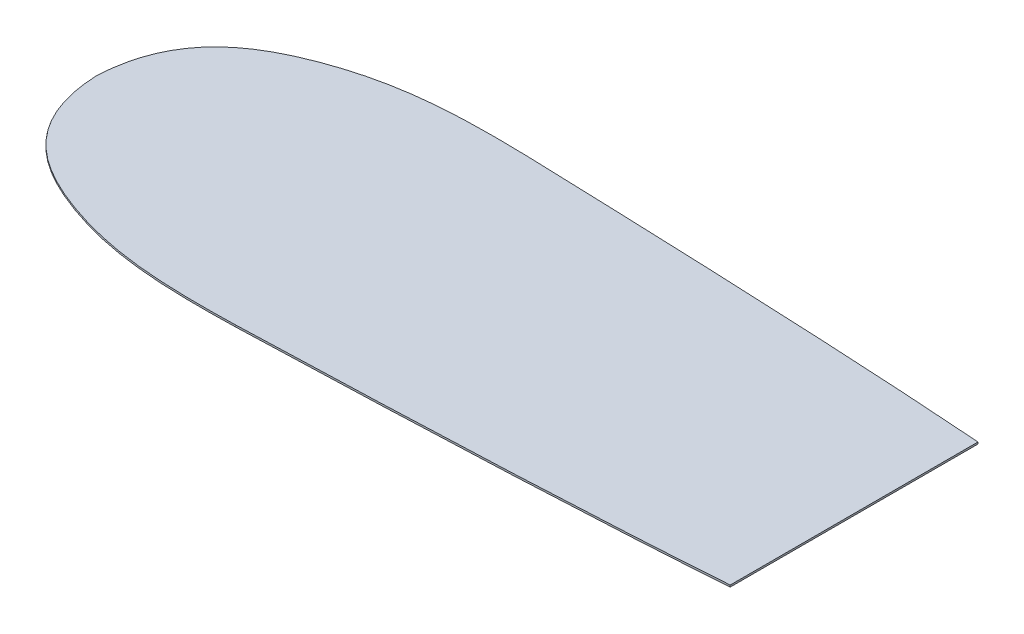
ISO-10303-21;
HEADER;
FILE_DESCRIPTION(('STEP AP214'),'2;1');
FILE_NAME('part.step','',(''),(''),'','','');
FILE_SCHEMA(('AUTOMOTIVE_DESIGN { 1 0 10303 214 1 1 1 1 }'));
ENDSEC;
DATA;
#1=APPLICATION_CONTEXT('core data for automotive mechanical design processes');
#2=APPLICATION_PROTOCOL_DEFINITION('international standard','automotive_design',2000,#1);
#3=PRODUCT_CONTEXT('',#1,'mechanical');
#4=PRODUCT('Part','Part','',(#3));
#5=PRODUCT_RELATED_PRODUCT_CATEGORY('part','',(#4));
#6=PRODUCT_DEFINITION_FORMATION('','',#4);
#7=PRODUCT_DEFINITION_CONTEXT('part definition',#1,'design');
#8=PRODUCT_DEFINITION('design','',#6,#7);
#9=PRODUCT_DEFINITION_SHAPE('','',#8);
#10=(LENGTH_UNIT() NAMED_UNIT(*) SI_UNIT(.MILLI.,.METRE.));
#11=(NAMED_UNIT(*) PLANE_ANGLE_UNIT() SI_UNIT($,.RADIAN.));
#12=(NAMED_UNIT(*) SI_UNIT($,.STERADIAN.) SOLID_ANGLE_UNIT());
#13=UNCERTAINTY_MEASURE_WITH_UNIT(LENGTH_MEASURE(1.E-05),#10,'distance_accuracy_value','');
#14=(GEOMETRIC_REPRESENTATION_CONTEXT(3) GLOBAL_UNCERTAINTY_ASSIGNED_CONTEXT((#13)) GLOBAL_UNIT_ASSIGNED_CONTEXT((#10,
#11,#12)) REPRESENTATION_CONTEXT('',''));
#15=CARTESIAN_POINT('',(0.,0.,0.));
#16=DIRECTION('',(0.,0.,1.));
#17=DIRECTION('',(1.,0.,0.));
#18=AXIS2_PLACEMENT_3D('',#15,#16,#17);
#19=CARTESIAN_POINT('',(408.55786592669,-53.8054593201718,-67.9864555983957));
#20=CARTESIAN_POINT('',(405.510783420296,-53.8054593201718,-68.2125918880234));
#21=CARTESIAN_POINT('',(400.163981406909,-53.8054593201718,-68.5997088697524));
#22=CARTESIAN_POINT('',(392.250191928234,-53.8054593201718,-69.1488737365903));
#23=CARTESIAN_POINT('',(384.914397369842,-53.8054593201718,-69.6396549512759));
#24=CARTESIAN_POINT('',(374.982367763208,-53.8054593201718,-70.2810009126777));
#25=CARTESIAN_POINT('',(362.311251705908,-53.8054593201718,-71.0577519191519));
#26=CARTESIAN_POINT('',(346.740657608973,-53.8054593201718,-71.9514358969247));
#27=CARTESIAN_POINT('',(330.853990323014,-53.8054593201718,-72.8078328315605));
#28=CARTESIAN_POINT('',(309.314194489395,-53.8054593201718,-73.901615514884));
#29=CARTESIAN_POINT('',(281.839500237322,-53.8054593201718,-75.1817055951182));
#30=CARTESIAN_POINT('',(248.374978256432,-53.8054593201718,-76.5881028931925));
#31=CARTESIAN_POINT('',(220.395834826739,-53.8054593201718,-77.6600997884309));
#32=CARTESIAN_POINT('',(198.15035735344,-53.8054593201718,-78.4625882976674));
#33=CARTESIAN_POINT('',(181.581427956624,-53.8054593201718,-79.0380575632732));
#34=CARTESIAN_POINT('',(167.916202612748,-53.8054593201718,-79.4968375830163));
#35=CARTESIAN_POINT('',(157.085804706728,-53.8054593201718,-79.8513358953218));
#36=CARTESIAN_POINT('',(151.73308734373,-53.8054593201718,-80.0252689768728));
#37=CARTESIAN_POINT('',(149.052426061608,-53.8054593201718,-80.1099839148504));
#38=B_SPLINE_CURVE_WITH_KNOTS('',3,(#19,#20,#21,#22,#23,#24,#25,#26,#27,#28,#29,#30,#31,#32,#33,
#34,#35,#36,#37),.UNSPECIFIED.,.F.,.F.,(4,1,1,1,1,1,1,1,1,1,1,1,1,1,1,1,4),(0.431997815299734,
0.454757420142134,0.472524007466795,0.490290594791455,0.508057182116116,0.543590356765438,
0.579123531414759,0.614656706064081,0.650189880713402,0.721256230012046,0.792322579310689,
0.863388928609332,0.898922103258653,0.934455277907975,0.969988452557297,0.987755039881957,
1.00548018721655),.UNSPECIFIED.);
#39=DIRECTION('',(0.,-1.,0.));
#40=VECTOR('',#39,1.);
#41=SURFACE_OF_LINEAR_EXTRUSION('',#38,#40);
#42=CARTESIAN_POINT('',(408.55786592669,-54.8054593201718,-67.9864555983957));
#43=CARTESIAN_POINT('',(405.510783420296,-54.8054593201718,-68.2125918880234));
#44=CARTESIAN_POINT('',(400.163981406909,-54.8054593201718,-68.5997088697524));
#45=CARTESIAN_POINT('',(392.250191928234,-54.8054593201718,-69.1488737365903));
#46=CARTESIAN_POINT('',(384.914397369842,-54.8054593201718,-69.6396549512759));
#47=CARTESIAN_POINT('',(374.982367763208,-54.8054593201718,-70.2810009126777));
#48=CARTESIAN_POINT('',(362.311251705908,-54.8054593201718,-71.0577519191519));
#49=CARTESIAN_POINT('',(346.740657608973,-54.8054593201718,-71.9514358969247));
#50=CARTESIAN_POINT('',(330.853990323014,-54.8054593201718,-72.8078328315605));
#51=CARTESIAN_POINT('',(309.314194489395,-54.8054593201718,-73.901615514884));
#52=CARTESIAN_POINT('',(281.839500237322,-54.8054593201718,-75.1817055951182));
#53=CARTESIAN_POINT('',(248.374978256432,-54.8054593201718,-76.5881028931925));
#54=CARTESIAN_POINT('',(220.395834826739,-54.8054593201718,-77.6600997884309));
#55=CARTESIAN_POINT('',(198.15035735344,-54.8054593201718,-78.4625882976674));
#56=CARTESIAN_POINT('',(181.581427956624,-54.8054593201718,-79.0380575632732));
#57=CARTESIAN_POINT('',(167.916202612748,-54.8054593201718,-79.4968375830163));
#58=CARTESIAN_POINT('',(157.085804706728,-54.8054593201718,-79.8513358953218));
#59=CARTESIAN_POINT('',(151.73308734373,-54.8054593201718,-80.0252689768728));
#60=CARTESIAN_POINT('',(149.052426061608,-54.8054593201718,-80.1099839148504));
#61=B_SPLINE_CURVE_WITH_KNOTS('',3,(#42,#43,#44,#45,#46,#47,#48,#49,#50,#51,#52,#53,#54,#55,#56,
#57,#58,#59,#60),.UNSPECIFIED.,.F.,.F.,(4,1,1,1,1,1,1,1,1,1,1,1,1,1,1,1,4),(0.431997815299734,
0.454757420142134,0.472524007466795,0.490290594791455,0.508057182116116,0.543590356765438,
0.579123531414759,0.614656706064081,0.650189880713402,0.721256230012046,0.792322579310689,
0.863388928609332,0.898922103258653,0.934455277907975,0.969988452557297,0.987755039881957,
1.00548018721655),.UNSPECIFIED.);
#62=CARTESIAN_POINT('',(408.55786592669,-54.8054593201718,-67.9864555983957));
#63=VERTEX_POINT('',#62);
#64=CARTESIAN_POINT('',(149.052426061608,-54.8054593201718,-80.1099839148504));
#65=VERTEX_POINT('',#64);
#66=EDGE_CURVE('E196',#63,#65,#61,.T.);
#67=ORIENTED_EDGE('',*,*,#66,.T.);
#68=DIRECTION('',(0.,-1.,0.));
#69=VECTOR('',#68,1.);
#70=CARTESIAN_POINT('',(149.052426061608,-53.8054593201718,-80.1099839148504));
#71=LINE('',#70,#69);
#72=CARTESIAN_POINT('',(149.052426061608,-53.8054593201718,-80.1099839148504));
#73=VERTEX_POINT('',#72);
#74=EDGE_CURVE('E11',#73,#65,#71,.T.);
#75=ORIENTED_EDGE('',*,*,#74,.F.);
#76=CARTESIAN_POINT('',(408.55786592669,-53.8054593201718,-67.9864555983957));
#77=VERTEX_POINT('',#76);
#78=EDGE_CURVE('E162',#77,#73,#38,.T.);
#79=ORIENTED_EDGE('',*,*,#78,.F.);
#80=DIRECTION('',(0.,-1.,0.));
#81=VECTOR('',#80,1.);
#82=CARTESIAN_POINT('',(408.55786592669,-53.8054593201718,-67.9864555983957));
#83=LINE('',#82,#81);
#84=EDGE_CURVE('E124',#77,#63,#83,.T.);
#85=ORIENTED_EDGE('',*,*,#84,.T.);
#86=EDGE_LOOP('',(#67,#75,#79,#85));
#87=FACE_BOUND('',#86,.T.);
#88=ADVANCED_FACE('F37',(#87),#41,.F.);
#89=CARTESIAN_POINT('',(149.028750543071,-53.8054593201718,-80.11066733118));
#90=DIRECTION('',(-0.0288539311335215,0.,0.999583638650684));
#91=DIRECTION('',(0.999583638650684,0.,0.0288539311335215));
#92=AXIS2_PLACEMENT_3D('',#89,#90,#91);
#93=PLANE('',#92);
#94=DIRECTION('',(-0.999583638650684,0.,-0.0288539311335215));
#95=VECTOR('',#94,1.);
#96=CARTESIAN_POINT('',(149.028750543071,-54.8054593201718,-80.11066733118));
#97=LINE('',#96,#95);
#98=CARTESIAN_POINT('',(149.028750543071,-54.8054593201718,-80.11066733118));
#99=VERTEX_POINT('',#98);
#100=EDGE_CURVE('E192',#65,#99,#97,.T.);
#101=ORIENTED_EDGE('',*,*,#100,.T.);
#102=DIRECTION('',(0.,-1.,0.));
#103=VECTOR('',#102,1.);
#104=CARTESIAN_POINT('',(149.028750543071,-53.8054593201718,-80.11066733118));
#105=LINE('',#104,#103);
#106=CARTESIAN_POINT('',(149.028750543071,-53.8054593201718,-80.11066733118));
#107=VERTEX_POINT('',#106);
#108=EDGE_CURVE('E46',#107,#99,#105,.T.);
#109=ORIENTED_EDGE('',*,*,#108,.F.);
#110=DIRECTION('',(-0.999583638650684,0.,-0.0288539311335215));
#111=VECTOR('',#110,1.);
#112=CARTESIAN_POINT('',(149.028750543071,-53.8054593201718,-80.11066733118));
#113=LINE('',#112,#111);
#114=EDGE_CURVE('E94',#73,#107,#113,.T.);
#115=ORIENTED_EDGE('',*,*,#114,.F.);
#116=ORIENTED_EDGE('',*,*,#74,.T.);
#117=EDGE_LOOP('',(#101,#109,#115,#116));
#118=FACE_BOUND('',#117,.T.);
#119=ADVANCED_FACE('F221',(#118),#93,.F.);
#120=CARTESIAN_POINT('',(149.028750543071,-53.8054593201718,-80.11066733118));
#121=CARTESIAN_POINT('',(147.936484942707,-53.8054593201718,-80.1386493892276));
#122=CARTESIAN_POINT('',(145.736828581532,-53.8054593201718,-80.1916825245391));
#123=CARTESIAN_POINT('',(141.408319901193,-53.8054593201718,-80.2810310559996));
#124=CARTESIAN_POINT('',(136.077305493243,-53.8054593201718,-80.3596421931491));
#125=CARTESIAN_POINT('',(129.825005536494,-53.8054593201718,-80.3911964408756));
#126=CARTESIAN_POINT('',(121.661707268436,-53.8054593201718,-80.3374949657146));
#127=CARTESIAN_POINT('',(111.758463737462,-53.8054593201718,-80.0678700036652));
#128=CARTESIAN_POINT('',(96.4398148388706,-53.8054593201718,-79.107371438361));
#129=CARTESIAN_POINT('',(81.7392355131955,-53.8054593201718,-77.2086267598153));
#130=CARTESIAN_POINT('',(67.3006686165004,-53.8054593201718,-74.0803934381426));
#131=CARTESIAN_POINT('',(56.5150789245028,-53.8054593201718,-71.0465504739176));
#132=CARTESIAN_POINT('',(45.6701124182547,-53.8054593201718,-67.246019325421));
#133=CARTESIAN_POINT('',(34.7210770046295,-53.8054593201718,-62.618046065346));
#134=CARTESIAN_POINT('',(24.163921637311,-53.8054593201718,-56.8744169850821));
#135=CARTESIAN_POINT('',(14.4319882487774,-53.8054593201718,-49.7157372417068));
#136=CARTESIAN_POINT('',(7.36589000542728,-53.8054593201718,-42.3241872358674));
#137=CARTESIAN_POINT('',(2.53983813162882,-53.8054593201718,-35.3923832609049));
#138=CARTESIAN_POINT('',(-0.61608136272,-53.8054593201718,-29.6389185438804));
#139=CARTESIAN_POINT('',(-3.25637865488616,-53.8054593201718,-23.2838176192413));
#140=CARTESIAN_POINT('',(-4.98135778889993,-53.8054593201718,-17.4465742838462));
#141=CARTESIAN_POINT('',(-6.04739649435333,-53.8054593201718,-12.4277006341119));
#142=CARTESIAN_POINT('',(-6.68245616737414,-53.8054593201718,-8.48450608083049));
#143=CARTESIAN_POINT('',(-7.06854682921263,-53.8054593201718,-5.04024353060589));
#144=CARTESIAN_POINT('',(-7.28732861568636,-53.8054593201718,-2.19688642431227));
#145=CARTESIAN_POINT('',(-7.36676882648855,-53.8054593201718,-0.728822352487011));
#146=CARTESIAN_POINT('',(-7.39811467827044,-53.8054593201718,0.));
#147=B_SPLINE_CURVE_WITH_KNOTS('',3,(#120,#121,#122,#123,#124,#125,#126,#127,#128,#129,#130,
#131,#132,#133,#134,#135,#136,#137,#138,#139,#140,#141,#142,#143,#144,#145,#146),.UNSPECIFIED.,
.F.,.F.,(4,1,1,1,1,1,1,1,1,1,1,1,1,1,1,1,1,1,1,1,1,1,1,1,4),(0.000305151712854408,
0.0128609903837068,0.0254814775346114,0.0507224518364203,0.0759634261382294,0.101204400440038,
0.151686349043657,0.202168297647275,0.303132194854511,0.353614143458129,0.404096092061747,
0.454578040665365,0.505059989268983,0.555541937872601,0.606023886476219,0.656505835079837,
0.681746809381646,0.706987783683455,0.732228757985264,0.757469732287074,0.770090219437978,
0.782710706588883,0.795331193739787,0.801641437315239,0.807951680890692),.UNSPECIFIED.);
#148=DIRECTION('',(0.,-1.,0.));
#149=VECTOR('',#148,1.);
#150=SURFACE_OF_LINEAR_EXTRUSION('',#147,#149);
#151=CARTESIAN_POINT('',(149.028750543071,-54.8054593201718,-80.11066733118));
#152=CARTESIAN_POINT('',(147.936484942707,-54.8054593201718,-80.1386493892276));
#153=CARTESIAN_POINT('',(145.736828581532,-54.8054593201718,-80.1916825245391));
#154=CARTESIAN_POINT('',(141.408319901193,-54.8054593201718,-80.2810310559996));
#155=CARTESIAN_POINT('',(136.077305493243,-54.8054593201718,-80.3596421931491));
#156=CARTESIAN_POINT('',(129.825005536494,-54.8054593201718,-80.3911964408756));
#157=CARTESIAN_POINT('',(121.661707268436,-54.8054593201718,-80.3374949657146));
#158=CARTESIAN_POINT('',(111.758463737462,-54.8054593201718,-80.0678700036652));
#159=CARTESIAN_POINT('',(96.4398148388706,-54.8054593201718,-79.107371438361));
#160=CARTESIAN_POINT('',(81.7392355131955,-54.8054593201718,-77.2086267598153));
#161=CARTESIAN_POINT('',(67.3006686165004,-54.8054593201718,-74.0803934381426));
#162=CARTESIAN_POINT('',(56.5150789245028,-54.8054593201718,-71.0465504739176));
#163=CARTESIAN_POINT('',(45.6701124182547,-54.8054593201718,-67.246019325421));
#164=CARTESIAN_POINT('',(34.7210770046295,-54.8054593201718,-62.618046065346));
#165=CARTESIAN_POINT('',(24.163921637311,-54.8054593201718,-56.8744169850821));
#166=CARTESIAN_POINT('',(14.4319882487774,-54.8054593201718,-49.7157372417068));
#167=CARTESIAN_POINT('',(7.36589000542728,-54.8054593201718,-42.3241872358674));
#168=CARTESIAN_POINT('',(2.53983813162882,-54.8054593201718,-35.3923832609049));
#169=CARTESIAN_POINT('',(-0.61608136272,-54.8054593201718,-29.6389185438804));
#170=CARTESIAN_POINT('',(-3.25637865488616,-54.8054593201718,-23.2838176192413));
#171=CARTESIAN_POINT('',(-4.98135778889993,-54.8054593201718,-17.4465742838462));
#172=CARTESIAN_POINT('',(-6.04739649435333,-54.8054593201718,-12.4277006341119));
#173=CARTESIAN_POINT('',(-6.68245616737414,-54.8054593201718,-8.48450608083049));
#174=CARTESIAN_POINT('',(-7.06854682921263,-54.8054593201718,-5.04024353060589));
#175=CARTESIAN_POINT('',(-7.28732861568636,-54.8054593201718,-2.19688642431227));
#176=CARTESIAN_POINT('',(-7.36676882648855,-54.8054593201718,-0.728822352487011));
#177=CARTESIAN_POINT('',(-7.39811467827044,-54.8054593201718,0.));
#178=B_SPLINE_CURVE_WITH_KNOTS('',3,(#151,#152,#153,#154,#155,#156,#157,#158,#159,#160,#161,
#162,#163,#164,#165,#166,#167,#168,#169,#170,#171,#172,#173,#174,#175,#176,#177),.UNSPECIFIED.,
.F.,.F.,(4,1,1,1,1,1,1,1,1,1,1,1,1,1,1,1,1,1,1,1,1,1,1,1,4),(0.000305151712854408,
0.0128609903837068,0.0254814775346114,0.0507224518364203,0.0759634261382294,0.101204400440038,
0.151686349043657,0.202168297647275,0.303132194854511,0.353614143458129,0.404096092061747,
0.454578040665365,0.505059989268983,0.555541937872601,0.606023886476219,0.656505835079837,
0.681746809381646,0.706987783683455,0.732228757985264,0.757469732287074,0.770090219437978,
0.782710706588883,0.795331193739787,0.801641437315239,0.807951680890692),.UNSPECIFIED.);
#179=CARTESIAN_POINT('',(-7.39811467827044,-54.8054593201718,0.));
#180=VERTEX_POINT('',#179);
#181=EDGE_CURVE('E187',#99,#180,#178,.T.);
#182=ORIENTED_EDGE('',*,*,#181,.T.);
#183=DIRECTION('',(0.,-1.,0.));
#184=VECTOR('',#183,1.);
#185=CARTESIAN_POINT('',(-7.39811467827044,-53.8054593201718,0.));
#186=LINE('',#185,#184);
#187=CARTESIAN_POINT('',(-7.39811467827044,-53.8054593201718,0.));
#188=VERTEX_POINT('',#187);
#189=EDGE_CURVE('E180',#188,#180,#186,.T.);
#190=ORIENTED_EDGE('',*,*,#189,.F.);
#191=EDGE_CURVE('E151',#107,#188,#147,.T.);
#192=ORIENTED_EDGE('',*,*,#191,.F.);
#193=ORIENTED_EDGE('',*,*,#108,.T.);
#194=EDGE_LOOP('',(#182,#190,#192,#193));
#195=FACE_BOUND('',#194,.T.);
#196=ADVANCED_FACE('F145',(#195),#150,.F.);
#197=CARTESIAN_POINT('',(-7.39811467827044,-53.8054593201718,0.));
#198=CARTESIAN_POINT('',(-7.36676882648855,-53.8054593201718,0.728822352487011));
#199=CARTESIAN_POINT('',(-7.28732861568636,-53.8054593201718,2.19688642431227));
#200=CARTESIAN_POINT('',(-7.06854682921263,-53.8054593201718,5.04024353060589));
#201=CARTESIAN_POINT('',(-6.68245616737414,-53.8054593201718,8.48450608083049));
#202=CARTESIAN_POINT('',(-6.04739649435333,-53.8054593201718,12.4277006341119));
#203=CARTESIAN_POINT('',(-4.98135778889993,-53.8054593201718,17.4465742838462));
#204=CARTESIAN_POINT('',(-3.25637865488616,-53.8054593201718,23.2838176192413));
#205=CARTESIAN_POINT('',(-0.61608136272,-53.8054593201718,29.6389185438804));
#206=CARTESIAN_POINT('',(2.53983813162882,-53.8054593201718,35.3923832609049));
#207=CARTESIAN_POINT('',(7.36589000542728,-53.8054593201718,42.3241872358674));
#208=CARTESIAN_POINT('',(14.4319882487774,-53.8054593201718,49.7157372417068));
#209=CARTESIAN_POINT('',(24.163921637311,-53.8054593201718,56.8744169850821));
#210=CARTESIAN_POINT('',(34.7210770046295,-53.8054593201718,62.6180460653461));
#211=CARTESIAN_POINT('',(45.6701124182547,-53.8054593201718,67.246019325421));
#212=CARTESIAN_POINT('',(56.5150789245028,-53.8054593201718,71.0465504739176));
#213=CARTESIAN_POINT('',(67.3006686165004,-53.8054593201718,74.0803934381426));
#214=CARTESIAN_POINT('',(81.7392355131955,-53.8054593201718,77.2086267598154));
#215=CARTESIAN_POINT('',(96.4398148388706,-53.8054593201718,79.107371438361));
#216=CARTESIAN_POINT('',(111.758463737462,-53.8054593201718,80.0678700036652));
#217=CARTESIAN_POINT('',(121.661707268436,-53.8054593201718,80.3374949657146));
#218=CARTESIAN_POINT('',(129.825005536494,-53.8054593201718,80.3911964408756));
#219=CARTESIAN_POINT('',(136.077305493243,-53.8054593201718,80.3596421931491));
#220=CARTESIAN_POINT('',(141.408319901193,-53.8054593201718,80.2810310559996));
#221=CARTESIAN_POINT('',(145.73682858153,-53.8054593201718,80.1916825245392));
#222=CARTESIAN_POINT('',(147.936484942703,-53.8054593201718,80.1386493892277));
#223=CARTESIAN_POINT('',(149.028750543065,-53.8054593201718,80.1106673311802));
#224=B_SPLINE_CURVE_WITH_KNOTS('',3,(#197,#198,#199,#200,#201,#202,#203,#204,#205,#206,#207,
#208,#209,#210,#211,#212,#213,#214,#215,#216,#217,#218,#219,#220,#221,#222,#223),.UNSPECIFIED.,
.F.,.F.,(4,1,1,1,1,1,1,1,1,1,1,1,1,1,1,1,1,1,1,1,1,1,1,1,4),(0.000240503232802295,
0.00655074680825455,0.0128609903837068,0.0254814775346113,0.0381019646855159,0.0507224518364204,
0.0759634261382294,0.101204400440038,0.126445374741847,0.151686349043657,0.202168297647275,
0.252650246250893,0.303132194854511,0.353614143458129,0.404096092061747,0.454578040665365,
0.505059989268983,0.606023886476219,0.656505835079837,0.706987783683455,0.732228757985265,
0.757469732287074,0.782710706588883,0.795331193739787,0.807887032410617),.UNSPECIFIED.);
#225=DIRECTION('',(0.,-1.,0.));
#226=VECTOR('',#225,1.);
#227=SURFACE_OF_LINEAR_EXTRUSION('',#224,#226);
#228=CARTESIAN_POINT('',(-7.39811467827044,-54.8054593201718,0.));
#229=CARTESIAN_POINT('',(-7.36676882648855,-54.8054593201718,0.728822352487011));
#230=CARTESIAN_POINT('',(-7.28732861568636,-54.8054593201718,2.19688642431227));
#231=CARTESIAN_POINT('',(-7.06854682921263,-54.8054593201718,5.04024353060589));
#232=CARTESIAN_POINT('',(-6.68245616737414,-54.8054593201718,8.48450608083049));
#233=CARTESIAN_POINT('',(-6.04739649435333,-54.8054593201718,12.4277006341119));
#234=CARTESIAN_POINT('',(-4.98135778889993,-54.8054593201718,17.4465742838462));
#235=CARTESIAN_POINT('',(-3.25637865488616,-54.8054593201718,23.2838176192413));
#236=CARTESIAN_POINT('',(-0.61608136272,-54.8054593201718,29.6389185438804));
#237=CARTESIAN_POINT('',(2.53983813162882,-54.8054593201718,35.3923832609049));
#238=CARTESIAN_POINT('',(7.36589000542728,-54.8054593201718,42.3241872358674));
#239=CARTESIAN_POINT('',(14.4319882487774,-54.8054593201718,49.7157372417068));
#240=CARTESIAN_POINT('',(24.163921637311,-54.8054593201718,56.8744169850821));
#241=CARTESIAN_POINT('',(34.7210770046295,-54.8054593201718,62.6180460653461));
#242=CARTESIAN_POINT('',(45.6701124182547,-54.8054593201718,67.246019325421));
#243=CARTESIAN_POINT('',(56.5150789245028,-54.8054593201718,71.0465504739176));
#244=CARTESIAN_POINT('',(67.3006686165004,-54.8054593201718,74.0803934381426));
#245=CARTESIAN_POINT('',(81.7392355131955,-54.8054593201718,77.2086267598154));
#246=CARTESIAN_POINT('',(96.4398148388706,-54.8054593201718,79.107371438361));
#247=CARTESIAN_POINT('',(111.758463737462,-54.8054593201718,80.0678700036652));
#248=CARTESIAN_POINT('',(121.661707268436,-54.8054593201718,80.3374949657146));
#249=CARTESIAN_POINT('',(129.825005536494,-54.8054593201718,80.3911964408756));
#250=CARTESIAN_POINT('',(136.077305493243,-54.8054593201718,80.3596421931491));
#251=CARTESIAN_POINT('',(141.408319901193,-54.8054593201718,80.2810310559996));
#252=CARTESIAN_POINT('',(145.73682858153,-54.8054593201718,80.1916825245392));
#253=CARTESIAN_POINT('',(147.936484942703,-54.8054593201718,80.1386493892277));
#254=CARTESIAN_POINT('',(149.028750543065,-54.8054593201718,80.1106673311802));
#255=B_SPLINE_CURVE_WITH_KNOTS('',3,(#228,#229,#230,#231,#232,#233,#234,#235,#236,#237,#238,
#239,#240,#241,#242,#243,#244,#245,#246,#247,#248,#249,#250,#251,#252,#253,#254),.UNSPECIFIED.,
.F.,.F.,(4,1,1,1,1,1,1,1,1,1,1,1,1,1,1,1,1,1,1,1,1,1,1,1,4),(0.000240503232802295,
0.00655074680825455,0.0128609903837068,0.0254814775346113,0.0381019646855159,0.0507224518364204,
0.0759634261382294,0.101204400440038,0.126445374741847,0.151686349043657,0.202168297647275,
0.252650246250893,0.303132194854511,0.353614143458129,0.404096092061747,0.454578040665365,
0.505059989268983,0.606023886476219,0.656505835079837,0.706987783683455,0.732228757985265,
0.757469732287074,0.782710706588883,0.795331193739787,0.807887032410617),.UNSPECIFIED.);
#256=CARTESIAN_POINT('',(149.028750543065,-54.8054593201718,80.1106673311802));
#257=VERTEX_POINT('',#256);
#258=EDGE_CURVE('E193',#180,#257,#255,.T.);
#259=ORIENTED_EDGE('',*,*,#258,.T.);
#260=DIRECTION('',(0.,-1.,0.));
#261=VECTOR('',#260,1.);
#262=CARTESIAN_POINT('',(149.028750543065,-53.8054593201718,80.1106673311802));
#263=LINE('',#262,#261);
#264=CARTESIAN_POINT('',(149.028750543065,-53.8054593201718,80.1106673311802));
#265=VERTEX_POINT('',#264);
#266=EDGE_CURVE('E119',#265,#257,#263,.T.);
#267=ORIENTED_EDGE('',*,*,#266,.F.);
#268=EDGE_CURVE('E110',#188,#265,#224,.T.);
#269=ORIENTED_EDGE('',*,*,#268,.F.);
#270=ORIENTED_EDGE('',*,*,#189,.T.);
#271=EDGE_LOOP('',(#259,#267,#269,#270));
#272=FACE_BOUND('',#271,.T.);
#273=ADVANCED_FACE('F142',(#272),#227,.F.);
#274=CARTESIAN_POINT('',(149.028750543065,-53.8054593201718,80.1106673311802));
#275=DIRECTION('',(-0.0282297308406689,0.,-0.999601461731956));
#276=DIRECTION('',(-0.999601461731956,0.,0.0282297308406689));
#277=AXIS2_PLACEMENT_3D('',#274,#275,#276);
#278=PLANE('',#277);
#279=DIRECTION('',(0.999601461731956,0.,-0.0282297308406689));
#280=VECTOR('',#279,1.);
#281=CARTESIAN_POINT('',(149.028750543065,-54.8054593201718,80.1106673311802));
#282=LINE('',#281,#280);
#283=CARTESIAN_POINT('',(149.048023413989,-54.8054593201718,80.1101230463031));
#284=VERTEX_POINT('',#283);
#285=EDGE_CURVE('E118',#257,#284,#282,.T.);
#286=ORIENTED_EDGE('',*,*,#285,.T.);
#287=DIRECTION('',(0.,-1.,0.));
#288=VECTOR('',#287,1.);
#289=CARTESIAN_POINT('',(149.048023413989,-53.8054593201718,80.1101230463031));
#290=LINE('',#289,#288);
#291=CARTESIAN_POINT('',(149.048023413989,-53.8054593201718,80.1101230463031));
#292=VERTEX_POINT('',#291);
#293=EDGE_CURVE('E115',#292,#284,#290,.T.);
#294=ORIENTED_EDGE('',*,*,#293,.F.);
#295=DIRECTION('',(0.999601461731956,0.,-0.0282297308406689));
#296=VECTOR('',#295,1.);
#297=CARTESIAN_POINT('',(149.028750543065,-53.8054593201718,80.1106673311802));
#298=LINE('',#297,#296);
#299=EDGE_CURVE('E104',#265,#292,#298,.T.);
#300=ORIENTED_EDGE('',*,*,#299,.F.);
#301=ORIENTED_EDGE('',*,*,#266,.T.);
#302=EDGE_LOOP('',(#286,#294,#300,#301));
#303=FACE_BOUND('',#302,.T.);
#304=ADVANCED_FACE('F116',(#303),#278,.F.);
#305=CARTESIAN_POINT('',(149.048023413989,-53.8054593201718,80.1101230463031));
#306=CARTESIAN_POINT('',(151.730160385622,-53.8054593201718,80.0253640863907));
#307=CARTESIAN_POINT('',(157.084325004698,-53.8054593201718,79.8513843286247));
#308=CARTESIAN_POINT('',(167.916202609567,-53.8054593201718,79.4968375831269));
#309=CARTESIAN_POINT('',(181.581427953442,-53.8054593201718,79.0380575633838));
#310=CARTESIAN_POINT('',(198.150357350258,-53.8054593201718,78.462588297778));
#311=CARTESIAN_POINT('',(220.395834823557,-53.8054593201718,77.6600997885415));
#312=CARTESIAN_POINT('',(248.37497825325,-53.8054593201718,76.5881028933031));
#313=CARTESIAN_POINT('',(281.839500234141,-53.8054593201718,75.1817055952288));
#314=CARTESIAN_POINT('',(309.314194486213,-53.8054593201718,73.9016155149946));
#315=CARTESIAN_POINT('',(330.853990319833,-53.8054593201718,72.8078328316711));
#316=CARTESIAN_POINT('',(346.740657605791,-53.8054593201718,71.9514358970353));
#317=CARTESIAN_POINT('',(362.311251702726,-53.8054593201718,71.0577519192625));
#318=CARTESIAN_POINT('',(374.982367760026,-53.8054593201718,70.2810009127883));
#319=CARTESIAN_POINT('',(384.91439736666,-53.8054593201718,69.6396549513865));
#320=CARTESIAN_POINT('',(392.250191925052,-53.8054593201718,69.1488737367009));
#321=CARTESIAN_POINT('',(400.163981403809,-53.8054593201718,68.5997088698574));
#322=CARTESIAN_POINT('',(405.510783417272,-53.8054593201718,68.2125918881226));
#323=CARTESIAN_POINT('',(408.557865923745,-53.8054593201718,67.9864555984887));
#324=B_SPLINE_CURVE_WITH_KNOTS('',3,(#305,#306,#307,#308,#309,#310,#311,#312,#313,#314,#315,
#316,#317,#318,#319,#320,#321,#322,#323),.UNSPECIFIED.,.F.,.F.,(4,1,1,1,1,1,1,1,1,1,1,1,1,1,1,1,
4),(0.437022569057286,0.454757420142134,0.472524007466794,0.508057182116116,0.543590356765438,
0.579123531414759,0.650189880713402,0.721256230012046,0.792322579310689,0.82785575396001,
0.863388928609332,0.898922103258653,0.934455277907975,0.952221865232636,0.969988452557296,
0.987755039881957,1.01051464472495),.UNSPECIFIED.);
#325=DIRECTION('',(0.,-1.,0.));
#326=VECTOR('',#325,1.);
#327=SURFACE_OF_LINEAR_EXTRUSION('',#324,#326);
#328=CARTESIAN_POINT('',(149.048023413989,-54.8054593201718,80.1101230463031));
#329=CARTESIAN_POINT('',(151.730160385622,-54.8054593201718,80.0253640863907));
#330=CARTESIAN_POINT('',(157.084325004698,-54.8054593201718,79.8513843286247));
#331=CARTESIAN_POINT('',(167.916202609567,-54.8054593201718,79.4968375831269));
#332=CARTESIAN_POINT('',(181.581427953442,-54.8054593201718,79.0380575633838));
#333=CARTESIAN_POINT('',(198.150357350258,-54.8054593201718,78.462588297778));
#334=CARTESIAN_POINT('',(220.395834823557,-54.8054593201718,77.6600997885415));
#335=CARTESIAN_POINT('',(248.37497825325,-54.8054593201718,76.5881028933031));
#336=CARTESIAN_POINT('',(281.839500234141,-54.8054593201718,75.1817055952288));
#337=CARTESIAN_POINT('',(309.314194486213,-54.8054593201718,73.9016155149946));
#338=CARTESIAN_POINT('',(330.853990319833,-54.8054593201718,72.8078328316711));
#339=CARTESIAN_POINT('',(346.740657605791,-54.8054593201718,71.9514358970353));
#340=CARTESIAN_POINT('',(362.311251702726,-54.8054593201718,71.0577519192625));
#341=CARTESIAN_POINT('',(374.982367760026,-54.8054593201718,70.2810009127883));
#342=CARTESIAN_POINT('',(384.91439736666,-54.8054593201718,69.6396549513865));
#343=CARTESIAN_POINT('',(392.250191925052,-54.8054593201718,69.1488737367009));
#344=CARTESIAN_POINT('',(400.163981403809,-54.8054593201718,68.5997088698574));
#345=CARTESIAN_POINT('',(405.510783417272,-54.8054593201718,68.2125918881226));
#346=CARTESIAN_POINT('',(408.557865923745,-54.8054593201718,67.9864555984887));
#347=B_SPLINE_CURVE_WITH_KNOTS('',3,(#328,#329,#330,#331,#332,#333,#334,#335,#336,#337,#338,
#339,#340,#341,#342,#343,#344,#345,#346),.UNSPECIFIED.,.F.,.F.,(4,1,1,1,1,1,1,1,1,1,1,1,1,1,1,1,
4),(0.437022569057286,0.454757420142134,0.472524007466794,0.508057182116116,0.543590356765438,
0.579123531414759,0.650189880713402,0.721256230012046,0.792322579310689,0.82785575396001,
0.863388928609332,0.898922103258653,0.934455277907975,0.952221865232636,0.969988452557296,
0.987755039881957,1.01051464472495),.UNSPECIFIED.);
#348=CARTESIAN_POINT('',(408.557865923745,-54.8054593201718,67.9864555984887));
#349=VERTEX_POINT('',#348);
#350=EDGE_CURVE('E80',#284,#349,#347,.T.);
#351=ORIENTED_EDGE('',*,*,#350,.T.);
#352=DIRECTION('',(0.,-1.,0.));
#353=VECTOR('',#352,1.);
#354=CARTESIAN_POINT('',(408.557865923745,-53.8054593201718,67.9864555984887));
#355=LINE('',#354,#353);
#356=CARTESIAN_POINT('',(408.557865923745,-53.8054593201718,67.9864555984887));
#357=VERTEX_POINT('',#356);
#358=EDGE_CURVE('E120',#357,#349,#355,.T.);
#359=ORIENTED_EDGE('',*,*,#358,.F.);
#360=EDGE_CURVE('E108',#292,#357,#324,.T.);
#361=ORIENTED_EDGE('',*,*,#360,.F.);
#362=ORIENTED_EDGE('',*,*,#293,.T.);
#363=EDGE_LOOP('',(#351,#359,#361,#362));
#364=FACE_BOUND('',#363,.T.);
#365=ADVANCED_FACE('F122',(#364),#327,.F.);
#366=CARTESIAN_POINT('',(408.557865923745,-53.8054593201718,67.9864555984887));
#367=DIRECTION('',(-1.,0.,-2.16577445234967E-11));
#368=DIRECTION('',(-2.16577445234967E-11,0.,1.));
#369=AXIS2_PLACEMENT_3D('',#366,#367,#368);
#370=PLANE('',#369);
#371=DIRECTION('',(2.16577445234967E-11,0.,-1.));
#372=VECTOR('',#371,1.);
#373=CARTESIAN_POINT('',(408.557865923745,-54.8054593201718,67.9864555984887));
#374=LINE('',#373,#372);
#375=EDGE_CURVE('E86',#349,#63,#374,.T.);
#376=ORIENTED_EDGE('',*,*,#375,.T.);
#377=ORIENTED_EDGE('',*,*,#84,.F.);
#378=DIRECTION('',(2.16577445234967E-11,0.,-1.));
#379=VECTOR('',#378,1.);
#380=CARTESIAN_POINT('',(408.557865923745,-53.8054593201718,67.9864555984887));
#381=LINE('',#380,#379);
#382=EDGE_CURVE('E54',#357,#77,#381,.T.);
#383=ORIENTED_EDGE('',*,*,#382,.F.);
#384=ORIENTED_EDGE('',*,*,#358,.T.);
#385=EDGE_LOOP('',(#376,#377,#383,#384));
#386=FACE_BOUND('',#385,.T.);
#387=ADVANCED_FACE('F138',(#386),#370,.F.);
#388=CARTESIAN_POINT('',(282.933281758939,-53.8054593201718,-75.1078927020023));
#389=DIRECTION('',(0.,-1.,0.));
#390=DIRECTION('',(0.,0.,-1.));
#391=AXIS2_PLACEMENT_3D('',#388,#389,#390);
#392=PLANE('',#391);
#393=ORIENTED_EDGE('',*,*,#78,.T.);
#394=ORIENTED_EDGE('',*,*,#114,.T.);
#395=ORIENTED_EDGE('',*,*,#191,.T.);
#396=ORIENTED_EDGE('',*,*,#268,.T.);
#397=ORIENTED_EDGE('',*,*,#299,.T.);
#398=ORIENTED_EDGE('',*,*,#360,.T.);
#399=ORIENTED_EDGE('',*,*,#382,.T.);
#400=EDGE_LOOP('',(#393,#394,#395,#396,#397,#398,#399));
#401=FACE_BOUND('',#400,.T.);
#402=ADVANCED_FACE('F106',(#401),#392,.F.);
#403=CARTESIAN_POINT('',(282.933281758939,-54.8054593201718,-75.1078927020023));
#404=DIRECTION('',(0.,-1.,0.));
#405=DIRECTION('',(0.,0.,-1.));
#406=AXIS2_PLACEMENT_3D('',#403,#404,#405);
#407=PLANE('',#406);
#408=ORIENTED_EDGE('',*,*,#66,.F.);
#409=ORIENTED_EDGE('',*,*,#375,.F.);
#410=ORIENTED_EDGE('',*,*,#350,.F.);
#411=ORIENTED_EDGE('',*,*,#285,.F.);
#412=ORIENTED_EDGE('',*,*,#258,.F.);
#413=ORIENTED_EDGE('',*,*,#181,.F.);
#414=ORIENTED_EDGE('',*,*,#100,.F.);
#415=EDGE_LOOP('',(#408,#409,#410,#411,#412,#413,#414));
#416=FACE_BOUND('',#415,.T.);
#417=ADVANCED_FACE('F191',(#416),#407,.T.);
#418=CLOSED_SHELL('',(#88,#119,#196,#273,#304,#365,#387,#402,#417));
#419=MANIFOLD_SOLID_BREP('B2',#418);
#420=ADVANCED_BREP_SHAPE_REPRESENTATION('',(#18,#419),#14);
#421=SHAPE_DEFINITION_REPRESENTATION(#9,#420);
ENDSEC;
END-ISO-10303-21;
